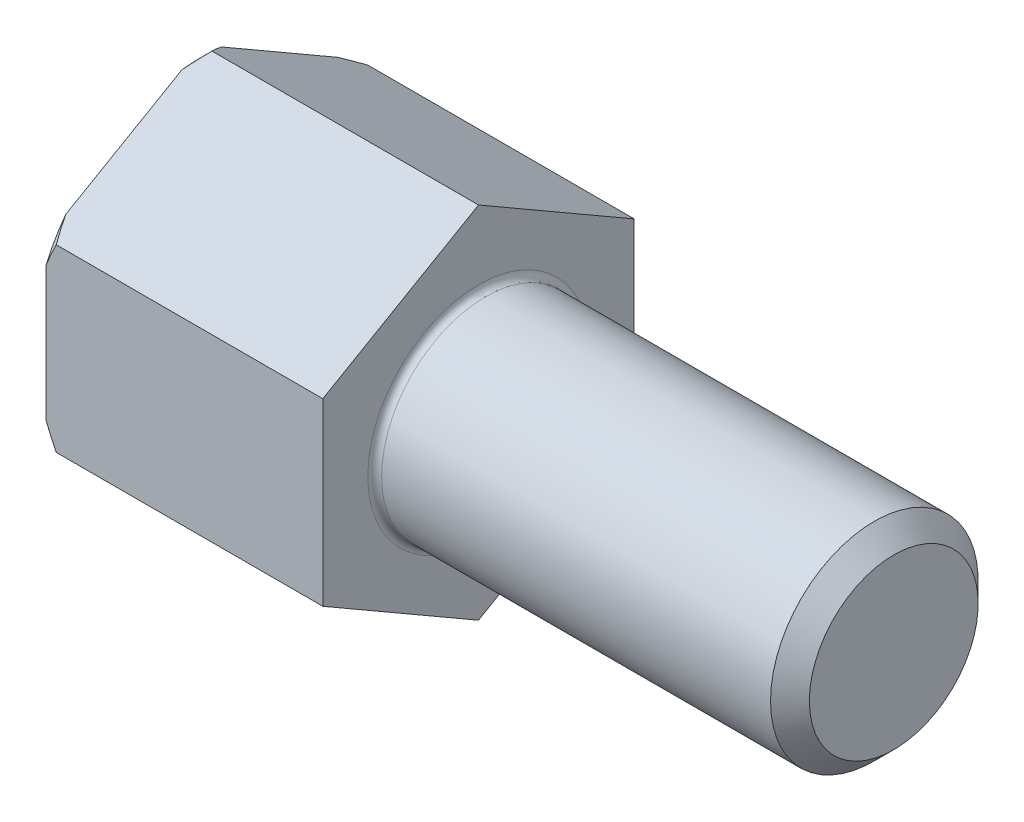
ISO-10303-21;
HEADER;
FILE_DESCRIPTION(('STEP AP214'),'2;1');
FILE_NAME('part.step','',(''),(''),'','','');
FILE_SCHEMA(('AUTOMOTIVE_DESIGN { 1 0 10303 214 1 1 1 1 }'));
ENDSEC;
DATA;
#1=APPLICATION_CONTEXT('core data for automotive mechanical design processes');
#2=APPLICATION_PROTOCOL_DEFINITION('international standard','automotive_design',2000,#1);
#3=PRODUCT_CONTEXT('',#1,'mechanical');
#4=PRODUCT('Part','Part','',(#3));
#5=PRODUCT_RELATED_PRODUCT_CATEGORY('part','',(#4));
#6=PRODUCT_DEFINITION_FORMATION('','',#4);
#7=PRODUCT_DEFINITION_CONTEXT('part definition',#1,'design');
#8=PRODUCT_DEFINITION('design','',#6,#7);
#9=PRODUCT_DEFINITION_SHAPE('','',#8);
#10=(LENGTH_UNIT() NAMED_UNIT(*) SI_UNIT(.MILLI.,.METRE.));
#11=(NAMED_UNIT(*) PLANE_ANGLE_UNIT() SI_UNIT($,.RADIAN.));
#12=(NAMED_UNIT(*) SI_UNIT($,.STERADIAN.) SOLID_ANGLE_UNIT());
#13=UNCERTAINTY_MEASURE_WITH_UNIT(LENGTH_MEASURE(1.E-05),#10,'distance_accuracy_value','');
#14=(GEOMETRIC_REPRESENTATION_CONTEXT(3) GLOBAL_UNCERTAINTY_ASSIGNED_CONTEXT((#13)) GLOBAL_UNIT_ASSIGNED_CONTEXT((#10,
#11,#12)) REPRESENTATION_CONTEXT('',''));
#15=CARTESIAN_POINT('',(0.,0.,0.));
#16=DIRECTION('',(0.,0.,1.));
#17=DIRECTION('',(1.,0.,0.));
#18=AXIS2_PLACEMENT_3D('',#15,#16,#17);
#19=CARTESIAN_POINT('',(4.,2.75,0.));
#20=DIRECTION('',(1.,0.,0.));
#21=DIRECTION('',(0.,0.,-1.));
#22=AXIS2_PLACEMENT_3D('',#19,#20,#21);
#23=PLANE('',#22);
#24=CARTESIAN_POINT('',(4.,0.,0.));
#25=DIRECTION('',(1.,0.,0.));
#26=DIRECTION('',(0.,0.,-1.));
#27=AXIS2_PLACEMENT_3D('',#24,#25,#26);
#28=CIRCLE('',#27,1.59999999999992);
#29=CARTESIAN_POINT('',(4.,0.,-1.59999999999992));
#30=VERTEX_POINT('',#29);
#31=EDGE_CURVE('E259',#30,#30,#28,.F.);
#32=ORIENTED_EDGE('',*,*,#31,.T.);
#33=EDGE_LOOP('',(#32));
#34=FACE_BOUND('',#33,.T.);
#35=DIRECTION('',(0.,0.5,-0.866025403784439));
#36=VECTOR('',#35,1.);
#37=CARTESIAN_POINT('',(4.,2.63605715851498,-0.0657849302036045));
#38=LINE('',#37,#36);
#39=CARTESIAN_POINT('',(4.,1.29903810567666,2.25));
#40=VERTEX_POINT('',#39);
#41=CARTESIAN_POINT('',(4.,2.59807621135332,0.));
#42=VERTEX_POINT('',#41);
#43=EDGE_CURVE('E246',#40,#42,#38,.T.);
#44=ORIENTED_EDGE('',*,*,#43,.F.);
#45=DIRECTION('',(0.,-1.,0.));
#46=VECTOR('',#45,1.);
#47=CARTESIAN_POINT('',(4.,2.75,2.24999999999999));
#48=LINE('',#47,#46);
#49=CARTESIAN_POINT('',(4.,-1.29903810567666,2.25));
#50=VERTEX_POINT('',#49);
#51=EDGE_CURVE('E236',#40,#50,#48,.T.);
#52=ORIENTED_EDGE('',*,*,#51,.T.);
#53=DIRECTION('',(0.,0.500000000000001,0.866025403784438));
#54=VECTOR('',#53,1.);
#55=CARTESIAN_POINT('',(4.,-1.26105715851499,2.31578493020361));
#56=LINE('',#55,#54);
#57=CARTESIAN_POINT('',(4.,-2.59807621135332,0.));
#58=VERTEX_POINT('',#57);
#59=EDGE_CURVE('E214',#58,#50,#56,.T.);
#60=ORIENTED_EDGE('',*,*,#59,.F.);
#61=DIRECTION('',(0.,-0.5,0.866025403784439));
#62=VECTOR('',#61,1.);
#63=CARTESIAN_POINT('',(4.,-1.26105715851499,-2.3157849302036));
#64=LINE('',#63,#62);
#65=CARTESIAN_POINT('',(4.,-1.29903810567666,-2.25));
#66=VERTEX_POINT('',#65);
#67=EDGE_CURVE('E205',#66,#58,#64,.T.);
#68=ORIENTED_EDGE('',*,*,#67,.F.);
#69=DIRECTION('',(0.,1.,0.));
#70=VECTOR('',#69,1.);
#71=CARTESIAN_POINT('',(4.,2.75,-2.25000000000001));
#72=LINE('',#71,#70);
#73=CARTESIAN_POINT('',(4.,1.29903810567665,-2.25));
#74=VERTEX_POINT('',#73);
#75=EDGE_CURVE('E195',#66,#74,#72,.T.);
#76=ORIENTED_EDGE('',*,*,#75,.T.);
#77=DIRECTION('',(0.,0.500000000000001,0.866025403784438));
#78=VECTOR('',#77,1.);
#79=CARTESIAN_POINT('',(4.,2.63605715851499,0.0657849302036022));
#80=LINE('',#79,#78);
#81=EDGE_CURVE('E167',#74,#42,#80,.T.);
#82=ORIENTED_EDGE('',*,*,#81,.T.);
#83=EDGE_LOOP('',(#44,#52,#60,#68,#76,#82));
#84=FACE_BOUND('',#83,.T.);
#85=ADVANCED_FACE('F40',(#34,#84),#23,.T.);
#86=CARTESIAN_POINT('',(10.,1.2195,0.));
#87=DIRECTION('',(1.,0.,0.));
#88=DIRECTION('',(0.,0.,-1.));
#89=AXIS2_PLACEMENT_3D('',#86,#87,#88);
#90=PLANE('',#89);
#91=CARTESIAN_POINT('',(10.,0.,0.));
#92=DIRECTION('',(-1.,0.,0.));
#93=DIRECTION('',(0.,0.,1.));
#94=AXIS2_PLACEMENT_3D('',#91,#92,#93);
#95=CIRCLE('',#94,1.2195);
#96=CARTESIAN_POINT('',(10.,0.,1.2195));
#97=VERTEX_POINT('',#96);
#98=EDGE_CURVE('E256',#97,#97,#95,.T.);
#99=ORIENTED_EDGE('',*,*,#98,.F.);
#100=EDGE_LOOP('',(#99));
#101=FACE_BOUND('',#100,.T.);
#102=ADVANCED_FACE('F329',(#101),#90,.T.);
#103=CARTESIAN_POINT('',(10.,0.,0.));
#104=DIRECTION('',(-1.,0.,0.));
#105=DIRECTION('',(0.,0.,1.));
#106=AXIS2_PLACEMENT_3D('',#103,#104,#105);
#107=CONICAL_SURFACE('',#106,1.2195,0.785398163397172);
#108=CARTESIAN_POINT('',(9.71949999999993,0.,0.));
#109=DIRECTION('',(-1.,0.,0.));
#110=DIRECTION('',(0.,0.,1.));
#111=AXIS2_PLACEMENT_3D('',#108,#109,#110);
#112=CIRCLE('',#111,1.49999999999992);
#113=CARTESIAN_POINT('',(9.71949999999993,0.,1.49999999999992));
#114=VERTEX_POINT('',#113);
#115=EDGE_CURVE('E252',#114,#114,#112,.T.);
#116=ORIENTED_EDGE('',*,*,#115,.F.);
#117=EDGE_LOOP('',(#116));
#118=FACE_BOUND('',#117,.T.);
#119=ORIENTED_EDGE('',*,*,#98,.T.);
#120=EDGE_LOOP('',(#119));
#121=FACE_BOUND('',#120,.T.);
#122=ADVANCED_FACE('F334',(#118,#121),#107,.T.);
#123=CARTESIAN_POINT('',(-31.75,0.,0.));
#124=DIRECTION('',(-1.,0.,0.));
#125=DIRECTION('',(0.,0.,1.));
#126=AXIS2_PLACEMENT_3D('',#123,#124,#125);
#127=CYLINDRICAL_SURFACE('',#126,1.49999999999992);
#128=CARTESIAN_POINT('',(4.1,0.,0.));
#129=DIRECTION('',(1.,0.,0.));
#130=DIRECTION('',(0.,0.,-1.));
#131=AXIS2_PLACEMENT_3D('',#128,#129,#130);
#132=CIRCLE('',#131,1.49999999999992);
#133=CARTESIAN_POINT('',(4.1,0.,-1.49999999999992));
#134=VERTEX_POINT('',#133);
#135=EDGE_CURVE('E262',#134,#134,#132,.T.);
#136=ORIENTED_EDGE('',*,*,#135,.T.);
#137=EDGE_LOOP('',(#136));
#138=FACE_BOUND('',#137,.T.);
#139=ORIENTED_EDGE('',*,*,#115,.T.);
#140=EDGE_LOOP('',(#139));
#141=FACE_BOUND('',#140,.T.);
#142=ADVANCED_FACE('F337',(#138,#141),#127,.T.);
#143=CARTESIAN_POINT('',(4.1,0.,0.));
#144=DIRECTION('',(1.,0.,0.));
#145=DIRECTION('',(0.,0.,-1.));
#146=AXIS2_PLACEMENT_3D('',#143,#144,#145);
#147=TOROIDAL_SURFACE('',#146,1.59999999999992,0.1);
#148=ORIENTED_EDGE('',*,*,#135,.F.);
#149=EDGE_LOOP('',(#148));
#150=FACE_BOUND('',#149,.T.);
#151=ORIENTED_EDGE('',*,*,#31,.F.);
#152=EDGE_LOOP('',(#151));
#153=FACE_BOUND('',#152,.T.);
#154=ADVANCED_FACE('F42',(#150,#153),#147,.F.);
#155=CARTESIAN_POINT('',(10.,2.59807621135332,0.));
#156=DIRECTION('',(0.,-0.866025403784439,-0.5));
#157=DIRECTION('',(0.,0.5,-0.866025403784439));
#158=AXIS2_PLACEMENT_3D('',#155,#156,#157);
#159=PLANE('',#158);
#160=DIRECTION('',(-1.,0.,0.));
#161=VECTOR('',#160,1.);
#162=CARTESIAN_POINT('',(10.,1.29903810567666,2.25));
#163=LINE('',#162,#161);
#164=CARTESIAN_POINT('',(0.148076211353313,1.29903810567666,2.25));
#165=VERTEX_POINT('',#164);
#166=EDGE_CURVE('E156',#40,#165,#163,.T.);
#167=ORIENTED_EDGE('',*,*,#166,.F.);
#168=ORIENTED_EDGE('',*,*,#43,.T.);
#169=DIRECTION('',(-1.,0.,0.));
#170=VECTOR('',#169,1.);
#171=CARTESIAN_POINT('',(10.,2.59807621135332,0.));
#172=LINE('',#171,#170);
#173=CARTESIAN_POINT('',(0.148076211353317,2.59807621135332,0.));
#174=VERTEX_POINT('',#173);
#175=EDGE_CURVE('E55',#42,#174,#172,.T.);
#176=ORIENTED_EDGE('',*,*,#175,.T.);
#177=CARTESIAN_POINT('',(1.38956349354383,3.50417181363964,-1.56940361967465));
#178=CARTESIAN_POINT('',(1.33965485491722,3.47337351467164,-1.51605940107536));
#179=CARTESIAN_POINT('',(1.29004887573799,3.44245277961855,-1.46250311695604));
#180=CARTESIAN_POINT('',(1.19155041800895,3.38032420316097,-1.35489326592958));
#181=CARTESIAN_POINT('',(1.14265800303582,3.34911633657284,-1.30083965540311));
#182=CARTESIAN_POINT('',(0.996999597779199,3.25485999237001,-1.13758287830811));
#183=CARTESIAN_POINT('',(0.901487238220858,3.19132262847131,-1.02753293585658));
#184=CARTESIAN_POINT('',(0.712599791533918,3.06075116421142,-0.801376525739781));
#185=CARTESIAN_POINT('',(0.619356927651705,2.99366895508622,-0.685186731250966));
#186=CARTESIAN_POINT('',(0.440289502999963,2.8571204547661,-0.448677790999188));
#187=CARTESIAN_POINT('',(0.354457521571661,2.78765664804196,-0.328362948465835));
#188=CARTESIAN_POINT('',(0.233314827318496,2.68020698894853,-0.142254679660051));
#189=CARTESIAN_POINT('',(0.193801904945935,2.64341516732573,-0.0785293753063631));
#190=CARTESIAN_POINT('',(0.118569264031108,2.56888100114376,0.0505675874205978));
#191=CARTESIAN_POINT('',(0.0828500853859291,2.53113852223719,0.115939478490372));
#192=CARTESIAN_POINT('',(-0.0168099276584709,2.41670826630443,0.314138495689022));
#193=CARTESIAN_POINT('',(-0.0737915552570118,2.33836371949835,0.449835231253115));
#194=CARTESIAN_POINT('',(-0.133519092591402,2.22580767076384,0.644788026360477));
#195=CARTESIAN_POINT('',(-0.148334695954519,2.19317239147085,0.701313988215142));
#196=CARTESIAN_POINT('',(-0.172655949928301,2.12741762504018,0.815204584512882));
#197=CARTESIAN_POINT('',(-0.182164445719272,2.09429840713775,0.872568752626841));
#198=CARTESIAN_POINT('',(-0.195390558823208,2.02782077232066,0.987711393697048));
#199=CARTESIAN_POINT('',(-0.199117133837629,1.99446280601135,1.04548908618194));
#200=CARTESIAN_POINT('',(-0.200603742240033,1.92771240286019,1.16110417586547));
#201=CARTESIAN_POINT('',(-0.198363708389566,1.89431996563411,1.21894157372959));
#202=CARTESIAN_POINT('',(-0.188055161119292,1.82785533205276,1.33406169599893));
#203=CARTESIAN_POINT('',(-0.180002420396564,1.79478251401188,1.39134549719521));
#204=CARTESIAN_POINT('',(-0.158498268310681,1.72907720866472,1.50515042438333));
#205=CARTESIAN_POINT('',(-0.145045608753623,1.6964448249689,1.56167137091657));
#206=CARTESIAN_POINT('',(-0.113295569447993,1.63167988967214,1.67384752939946));
#207=CARTESIAN_POINT('',(-0.094984022830986,1.59954909539925,1.72949969756766));
#208=CARTESIAN_POINT('',(-0.0542102947783968,1.53596253110388,1.83963485760598));
#209=CARTESIAN_POINT('',(-0.031748312812983,1.50450672872231,1.8941179055237));
#210=CARTESIAN_POINT('',(0.0253766525682736,1.43109498615018,2.02127077353081));
#211=CARTESIAN_POINT('',(0.0615231801772885,1.38942875415872,2.09343880429996));
#212=CARTESIAN_POINT('',(0.138862691263032,1.30727562859454,2.23573219177771));
#213=CARTESIAN_POINT('',(0.18005835494802,1.26678937562111,2.30585643893578));
#214=CARTESIAN_POINT('',(0.266445407392794,1.18679606165464,2.44440892299152));
#215=CARTESIAN_POINT('',(0.311644939815624,1.14729121577708,2.51283332319662));
#216=CARTESIAN_POINT('',(0.40509922301932,1.06921197761058,2.64807053071728));
#217=CARTESIAN_POINT('',(0.453353433521689,1.03063742243933,2.71488362015325));
#218=CARTESIAN_POINT('',(0.602154225761355,0.915733123098446,2.91390370461976));
#219=CARTESIAN_POINT('',(0.70633451845413,0.840582723881126,3.04406801427324));
#220=CARTESIAN_POINT('',(0.920718685183836,0.6926140991221,3.30035719028197));
#221=CARTESIAN_POINT('',(1.03091648150611,0.61979363408633,3.42648593555472));
#222=CARTESIAN_POINT('',(1.18384094334647,0.521729341033111,3.59633827353122));
#223=CARTESIAN_POINT('',(1.22475657221562,0.495774156911396,3.64129397114983));
#224=CARTESIAN_POINT('',(1.30690037748831,0.444165621284563,3.73068257695973));
#225=CARTESIAN_POINT('',(1.34812651717398,0.418511459642814,3.77511688834883));
#226=CARTESIAN_POINT('',(1.38956349354382,0.392942503390328,3.81940361967464));
#227=B_SPLINE_CURVE_WITH_KNOTS('',3,(#177,#178,#179,#180,#181,#182,#183,#184,#185,#186,#187,
#188,#189,#190,#191,#192,#193,#194,#195,#196,#197,#198,#199,#200,#201,#202,#203,#204,#205,#206,
#207,#208,#209,#210,#211,#212,#213,#214,#215,#216,#217,#218,#219,#220,#221,#222,#223,#224,#225,
#226),.UNSPECIFIED.,.F.,.F.,(4,2,2,2,2,2,2,2,2,2,2,2,2,2,2,2,2,2,2,2,2,2,2,2,4),(0.,
0.237831856298369,0.475684774989147,0.952504404028155,1.44251492737563,1.93202896156976,
2.18248661479591,2.43297986364782,2.93081336405965,3.13143070493916,3.33194038979179,
3.53213912161983,3.73234010952155,3.93199988728958,4.13170584311499,4.33200059690363,
4.53228572701713,4.80455934119044,5.07697811613419,5.34996429031275,5.62290231581841,
6.17125052849525,6.71905479718201,6.91734296941923,7.11479764663136),.UNSPECIFIED.);
#228=CARTESIAN_POINT('',(0.,2.43332514425662,0.285357218812662));
#229=VERTEX_POINT('',#228);
#230=EDGE_CURVE('E245',#174,#229,#227,.T.);
#231=ORIENTED_EDGE('',*,*,#230,.T.);
#232=DIRECTION('',(0.,-0.5,0.866025403784439));
#233=VECTOR('',#232,1.);
#234=CARTESIAN_POINT('',(0.,1.94855715851498,1.125));
#235=LINE('',#234,#233);
#236=CARTESIAN_POINT('',(0.,1.46378917277335,1.96464278118734));
#237=VERTEX_POINT('',#236);
#238=EDGE_CURVE('E12',#229,#237,#235,.T.);
#239=ORIENTED_EDGE('',*,*,#238,.T.);
#240=EDGE_CURVE('E239',#237,#165,#227,.T.);
#241=ORIENTED_EDGE('',*,*,#240,.T.);
#242=EDGE_LOOP('',(#167,#168,#176,#231,#239,#241));
#243=FACE_BOUND('',#242,.T.);
#244=ADVANCED_FACE('F225',(#243),#159,.F.);
#245=CARTESIAN_POINT('',(10.,-1.29903810567666,2.25));
#246=DIRECTION('',(0.,0.,1.));
#247=DIRECTION('',(0.,-1.,0.));
#248=AXIS2_PLACEMENT_3D('',#245,#246,#247);
#249=PLANE('',#248);
#250=ORIENTED_EDGE('',*,*,#51,.F.);
#251=ORIENTED_EDGE('',*,*,#166,.T.);
#252=CARTESIAN_POINT('',(1.19560803320055,-2.8684417253513,2.25));
#253=CARTESIAN_POINT('',(1.1450111615432,-2.80412487936931,2.25));
#254=CARTESIAN_POINT('',(1.09480208722197,-2.73949899660477,2.25));
#255=CARTESIAN_POINT('',(0.995326277795939,-2.60950974966499,2.25));
#256=CARTESIAN_POINT('',(0.946059699272549,-2.54414626576754,2.25));
#257=CARTESIAN_POINT('',(0.848405598993678,-2.41225017150865,2.25));
#258=CARTESIAN_POINT('',(0.800023797140556,-2.34571331505328,2.25));
#259=CARTESIAN_POINT('',(0.704636716137816,-2.21166271624502,2.25));
#260=CARTESIAN_POINT('',(0.657631371063428,-2.14414902090955,2.25));
#261=CARTESIAN_POINT('',(0.563002092351626,-2.0046050446458,2.25));
#262=CARTESIAN_POINT('',(0.515463194774029,-1.93251687730629,2.25));
#263=CARTESIAN_POINT('',(0.422679962261214,-1.78688032148459,2.25));
#264=CARTESIAN_POINT('',(0.377435435817015,-1.71333205559088,2.25));
#265=CARTESIAN_POINT('',(0.289907877591605,-1.56467215105607,2.25));
#266=CARTESIAN_POINT('',(0.247619387609034,-1.4895637448277,2.25));
#267=CARTESIAN_POINT('',(0.166684571928322,-1.33741813962644,2.25));
#268=CARTESIAN_POINT('',(0.12803725481263,-1.26038147295239,2.25));
#269=CARTESIAN_POINT('',(0.0591346790092825,-1.11224795470599,2.25));
#270=CARTESIAN_POINT('',(0.0284247431298476,-1.04136416293652,2.25));
#271=CARTESIAN_POINT('',(-0.0284074028507688,-0.897751599056984,2.25));
#272=CARTESIAN_POINT('',(-0.0545291725749484,-0.82502265061271,2.25));
#273=CARTESIAN_POINT('',(-0.100905921124525,-0.678605258667869,2.25));
#274=CARTESIAN_POINT('',(-0.121224363594545,-0.604937193851524,2.25));
#275=CARTESIAN_POINT('',(-0.155374302964485,-0.456118834886516,2.25));
#276=CARTESIAN_POINT('',(-0.169208398573311,-0.380969147127066,2.25));
#277=CARTESIAN_POINT('',(-0.189740473043699,-0.228249239988753,2.25));
#278=CARTESIAN_POINT('',(-0.196300267449367,-0.150660030751469,2.25));
#279=CARTESIAN_POINT('',(-0.201335754653149,0.00477860687580444,2.25));
#280=CARTESIAN_POINT('',(-0.199812150005818,0.0826280120635858,2.25));
#281=CARTESIAN_POINT('',(-0.188780749107252,0.237987187801296,2.25));
#282=CARTESIAN_POINT('',(-0.179248561980909,0.315495192827886,2.25));
#283=CARTESIAN_POINT('',(-0.152840224692754,0.469242252541659,2.25));
#284=CARTESIAN_POINT('',(-0.13596210656056,0.545480961498766,2.25));
#285=CARTESIAN_POINT('',(-0.0896292563756563,0.719670195710907,2.25));
#286=CARTESIAN_POINT('',(-0.0578965298682648,0.817009849952895,2.25));
#287=CARTESIAN_POINT('',(0.0140677894975261,1.00847620304259,2.25));
#288=CARTESIAN_POINT('',(0.0543044957444195,1.10260092904116,2.25));
#289=CARTESIAN_POINT('',(0.14150195099445,1.28847491564035,2.25));
#290=CARTESIAN_POINT('',(0.188509380032974,1.38020197886321,2.25));
#291=CARTESIAN_POINT('',(0.287389666851661,1.56093565221082,2.25));
#292=CARTESIAN_POINT('',(0.33926138454899,1.64994289335036,2.25));
#293=CARTESIAN_POINT('',(0.453947505487043,1.8375658055387,2.25));
#294=CARTESIAN_POINT('',(0.517293376499227,1.9358544228592,2.25));
#295=CARTESIAN_POINT('',(0.647509232001908,2.13008097858503,2.25));
#296=CARTESIAN_POINT('',(0.714379975487861,2.22601840414986,2.24999999999999));
#297=CARTESIAN_POINT('',(0.849264345549588,2.41388455145359,2.24999999999999));
#298=CARTESIAN_POINT('',(0.91722016115619,2.50585501474068,2.24999999999999));
#299=CARTESIAN_POINT('',(1.05507834370763,2.68822689085584,2.24999999999999));
#300=CARTESIAN_POINT('',(1.12497931307402,2.77862935814874,2.24999999999999));
#301=CARTESIAN_POINT('',(1.19560803320054,2.8684417253513,2.24999999999999));
#302=B_SPLINE_CURVE_WITH_KNOTS('',3,(#252,#253,#254,#255,#256,#257,#258,#259,#260,#261,#262,
#263,#264,#265,#266,#267,#268,#269,#270,#271,#272,#273,#274,#275,#276,#277,#278,#279,#280,#281,
#282,#283,#284,#285,#286,#287,#288,#289,#290,#291,#292,#293,#294,#295,#296,#297,#298,#299,#300,
#301),.UNSPECIFIED.,.F.,.F.,(4,2,2,2,2,2,2,2,2,2,2,2,2,2,2,2,2,2,2,2,2,2,2,2,4),(0.,
0.245503234786309,0.491046908091924,0.737834898600815,0.98461104991463,1.24363201899954,
1.50263133214255,1.76113903919262,2.0195761551799,2.25119815333278,2.48284237067425,
2.71184685405785,2.94075948148189,3.17394982672687,3.40711990497107,3.64100270929032,
3.87494820927291,4.18155383361919,4.48834434515738,4.79736136959428,5.10630614736502,
5.45700201658771,5.80777371057626,6.15080251895842,6.49359092254174),.UNSPECIFIED.);
#303=CARTESIAN_POINT('',(0.,0.969535971483272,2.25));
#304=VERTEX_POINT('',#303);
#305=EDGE_CURVE('E228',#304,#165,#302,.T.);
#306=ORIENTED_EDGE('',*,*,#305,.F.);
#307=DIRECTION('',(0.,1.,0.));
#308=VECTOR('',#307,1.);
#309=CARTESIAN_POINT('',(0.,0.,2.25));
#310=LINE('',#309,#308);
#311=CARTESIAN_POINT('',(0.,-0.969535971483266,2.25));
#312=VERTEX_POINT('',#311);
#313=EDGE_CURVE('E48',#312,#304,#310,.T.);
#314=ORIENTED_EDGE('',*,*,#313,.F.);
#315=CARTESIAN_POINT('',(0.148076211353318,-1.29903810567666,2.25));
#316=VERTEX_POINT('',#315);
#317=EDGE_CURVE('E235',#316,#312,#302,.T.);
#318=ORIENTED_EDGE('',*,*,#317,.F.);
#319=DIRECTION('',(-1.,0.,0.));
#320=VECTOR('',#319,1.);
#321=CARTESIAN_POINT('',(10.,-1.29903810567666,2.25));
#322=LINE('',#321,#320);
#323=EDGE_CURVE('E153',#50,#316,#322,.T.);
#324=ORIENTED_EDGE('',*,*,#323,.F.);
#325=EDGE_LOOP('',(#250,#251,#306,#314,#318,#324));
#326=FACE_BOUND('',#325,.T.);
#327=ADVANCED_FACE('F220',(#326),#249,.T.);
#328=CARTESIAN_POINT('',(10.,-1.29903810567666,2.25));
#329=DIRECTION('',(0.,0.866025403784438,-0.500000000000001));
#330=DIRECTION('',(0.,0.500000000000001,0.866025403784438));
#331=AXIS2_PLACEMENT_3D('',#328,#329,#330);
#332=PLANE('',#331);
#333=DIRECTION('',(-1.,0.,0.));
#334=VECTOR('',#333,1.);
#335=CARTESIAN_POINT('',(10.,-2.59807621135332,0.));
#336=LINE('',#335,#334);
#337=CARTESIAN_POINT('',(0.148076211353322,-2.59807621135332,0.));
#338=VERTEX_POINT('',#337);
#339=EDGE_CURVE('E150',#58,#338,#336,.T.);
#340=ORIENTED_EDGE('',*,*,#339,.F.);
#341=ORIENTED_EDGE('',*,*,#59,.T.);
#342=ORIENTED_EDGE('',*,*,#323,.T.);
#343=CARTESIAN_POINT('',(1.38956349354383,-0.392942503390329,3.81940361967464));
#344=CARTESIAN_POINT('',(1.33965485491722,-0.423740802358336,3.76605940107536));
#345=CARTESIAN_POINT('',(1.29004887573799,-0.454661537411425,3.71250311695603));
#346=CARTESIAN_POINT('',(1.19155041800895,-0.516790113869008,3.60489326592957));
#347=CARTESIAN_POINT('',(1.14265800303582,-0.547997980457137,3.5508396554031));
#348=CARTESIAN_POINT('',(0.996999597779196,-0.642254324659963,3.38758287830811));
#349=CARTESIAN_POINT('',(0.901487238220854,-0.705791688558662,3.27753293585657));
#350=CARTESIAN_POINT('',(0.712599791533914,-0.836363152818554,3.05137652573977));
#351=CARTESIAN_POINT('',(0.619356927651701,-0.903445361943759,2.93518673125096));
#352=CARTESIAN_POINT('',(0.440289502999958,-1.03999386226388,2.69867779099918));
#353=CARTESIAN_POINT('',(0.354457521571656,-1.10945766898802,2.57836294846582));
#354=CARTESIAN_POINT('',(0.233314827318492,-1.21690732808145,2.39225467966004));
#355=CARTESIAN_POINT('',(0.193801904945931,-1.25369914970424,2.32852937530635));
#356=CARTESIAN_POINT('',(0.118569264031106,-1.32823331588622,2.19943241257939));
#357=CARTESIAN_POINT('',(0.0828500853859275,-1.36597579479279,2.13406052150962));
#358=CARTESIAN_POINT('',(-0.0168099276584706,-1.48040605072555,1.93586150431097));
#359=CARTESIAN_POINT('',(-0.0737915552570104,-1.55875059753163,1.80016476874688));
#360=CARTESIAN_POINT('',(-0.133519092591399,-1.67130664626613,1.60521197363951));
#361=CARTESIAN_POINT('',(-0.148334695954516,-1.70394192555913,1.54868601178485));
#362=CARTESIAN_POINT('',(-0.172655949928298,-1.7696966919898,1.43479541548711));
#363=CARTESIAN_POINT('',(-0.182164445719268,-1.80281590989223,1.37743124737315));
#364=CARTESIAN_POINT('',(-0.195390558823203,-1.86929354470932,1.26228860630294));
#365=CARTESIAN_POINT('',(-0.199117133837623,-1.90265151101862,1.20451091381805));
#366=CARTESIAN_POINT('',(-0.200603742240027,-1.96940191416979,1.08889582413452));
#367=CARTESIAN_POINT('',(-0.19836370838956,-2.00279435139587,1.0310584262704));
#368=CARTESIAN_POINT('',(-0.188055161119285,-2.06925898497722,0.915938304001057));
#369=CARTESIAN_POINT('',(-0.180002420396556,-2.1023318030181,0.858654502804776));
#370=CARTESIAN_POINT('',(-0.158498268310673,-2.16803710836526,0.744849575616659));
#371=CARTESIAN_POINT('',(-0.145045608753614,-2.20066949206108,0.688328629083419));
#372=CARTESIAN_POINT('',(-0.113295569447984,-2.26543442735784,0.576152470600531));
#373=CARTESIAN_POINT('',(-0.0949840228309773,-2.29756522163073,0.520500302432332));
#374=CARTESIAN_POINT('',(-0.0542102947783875,-2.3611517859261,0.410365142394011));
#375=CARTESIAN_POINT('',(-0.031748312812973,-2.39260758830766,0.355882094476292));
#376=CARTESIAN_POINT('',(0.0253766525682851,-2.4660193308798,0.228729226469179));
#377=CARTESIAN_POINT('',(0.0615231801773006,-2.50768556287126,0.156561195700025));
#378=CARTESIAN_POINT('',(0.138862691263045,-2.58983868843544,0.0142678082222789));
#379=CARTESIAN_POINT('',(0.180058354948034,-2.63032494140888,-0.0558564389357974));
#380=CARTESIAN_POINT('',(0.26644540739281,-2.71031825537535,-0.194408922991534));
#381=CARTESIAN_POINT('',(0.311644939815641,-2.7498231012529,-0.262833323196639));
#382=CARTESIAN_POINT('',(0.405099223019339,-2.82790233941941,-0.398070530717296));
#383=CARTESIAN_POINT('',(0.453353433521709,-2.86647689459066,-0.46488362015327));
#384=CARTESIAN_POINT('',(0.602154225761378,-2.98138119393154,-0.663903704619781));
#385=CARTESIAN_POINT('',(0.706334518454154,-3.05653159314886,-0.794068014273264));
#386=CARTESIAN_POINT('',(0.920718685183864,-3.20450021790789,-1.05035719028199));
#387=CARTESIAN_POINT('',(1.03091648150614,-3.27732068294366,-1.17648593555474));
#388=CARTESIAN_POINT('',(1.1838409433465,-3.37538497599688,-1.34633827353124));
#389=CARTESIAN_POINT('',(1.22475657221565,-3.40134016011859,-1.39129397114985));
#390=CARTESIAN_POINT('',(1.30690037748832,-3.45294869574542,-1.48068257695975));
#391=CARTESIAN_POINT('',(1.34812651717399,-3.47860285738717,-1.52511688834884));
#392=CARTESIAN_POINT('',(1.38956349354383,-3.50417181363965,-1.56940361967464));
#393=B_SPLINE_CURVE_WITH_KNOTS('',3,(#343,#344,#345,#346,#347,#348,#349,#350,#351,#352,#353,
#354,#355,#356,#357,#358,#359,#360,#361,#362,#363,#364,#365,#366,#367,#368,#369,#370,#371,#372,
#373,#374,#375,#376,#377,#378,#379,#380,#381,#382,#383,#384,#385,#386,#387,#388,#389,#390,#391,
#392),.UNSPECIFIED.,.F.,.F.,(4,2,2,2,2,2,2,2,2,2,2,2,2,2,2,2,2,2,2,2,2,2,2,2,4),(0.,
0.23783185629837,0.475684774989149,0.95250440402816,1.44251492737564,1.93202896156977,
2.18248661479592,2.43297986364783,2.93081336405966,3.13143070493916,3.3319403897918,
3.53213912161983,3.73234010952156,3.93199988728959,4.13170584311499,4.33200059690363,
4.53228572701714,4.80455934119044,5.0769781161342,5.34996429031276,5.62290231581843,
6.17125052849528,6.71905479718204,6.91734296941924,7.11479764663135),.UNSPECIFIED.);
#394=CARTESIAN_POINT('',(0.,-1.46378917277336,1.96464278118733));
#395=VERTEX_POINT('',#394);
#396=EDGE_CURVE('E213',#316,#395,#393,.T.);
#397=ORIENTED_EDGE('',*,*,#396,.T.);
#398=DIRECTION('',(0.,-0.500000000000001,-0.866025403784438));
#399=VECTOR('',#398,1.);
#400=CARTESIAN_POINT('',(0.,-1.94855715851499,1.125));
#401=LINE('',#400,#399);
#402=CARTESIAN_POINT('',(0.,-2.43332514425662,0.285357218812678));
#403=VERTEX_POINT('',#402);
#404=EDGE_CURVE('E272',#395,#403,#401,.T.);
#405=ORIENTED_EDGE('',*,*,#404,.T.);
#406=EDGE_CURVE('E207',#403,#338,#393,.T.);
#407=ORIENTED_EDGE('',*,*,#406,.T.);
#408=EDGE_LOOP('',(#340,#341,#342,#397,#405,#407));
#409=FACE_BOUND('',#408,.T.);
#410=ADVANCED_FACE('F216',(#409),#332,.F.);
#411=CARTESIAN_POINT('',(10.,-2.59807621135332,0.));
#412=DIRECTION('',(0.,0.866025403784439,0.5));
#413=DIRECTION('',(0.,-0.5,0.866025403784439));
#414=AXIS2_PLACEMENT_3D('',#411,#412,#413);
#415=PLANE('',#414);
#416=DIRECTION('',(-1.,0.,0.));
#417=VECTOR('',#416,1.);
#418=CARTESIAN_POINT('',(10.,-1.29903810567666,-2.25));
#419=LINE('',#418,#417);
#420=CARTESIAN_POINT('',(0.14807621135332,-1.29903810567666,-2.25));
#421=VERTEX_POINT('',#420);
#422=EDGE_CURVE('E147',#66,#421,#419,.T.);
#423=ORIENTED_EDGE('',*,*,#422,.F.);
#424=ORIENTED_EDGE('',*,*,#67,.T.);
#425=ORIENTED_EDGE('',*,*,#339,.T.);
#426=CARTESIAN_POINT('',(1.38956349354383,-3.50417181363965,1.56940361967464));
#427=CARTESIAN_POINT('',(1.33965485491722,-3.47337351467164,1.51605940107536));
#428=CARTESIAN_POINT('',(1.29004887573799,-3.44245277961855,1.46250311695603));
#429=CARTESIAN_POINT('',(1.19155041800895,-3.38032420316097,1.35489326592957));
#430=CARTESIAN_POINT('',(1.14265800303582,-3.34911633657284,1.3008396554031));
#431=CARTESIAN_POINT('',(0.996999597779198,-3.25485999237001,1.13758287830811));
#432=CARTESIAN_POINT('',(0.901487238220856,-3.19132262847131,1.02753293585657));
#433=CARTESIAN_POINT('',(0.712599791533916,-3.06075116421142,0.801376525739768));
#434=CARTESIAN_POINT('',(0.619356927651702,-2.99366895508622,0.685186731250953));
#435=CARTESIAN_POINT('',(0.440289502999959,-2.8571204547661,0.448677790999172));
#436=CARTESIAN_POINT('',(0.354457521571657,-2.78765664804196,0.328362948465817));
#437=CARTESIAN_POINT('',(0.233314827318492,-2.68020698894852,0.142254679660032));
#438=CARTESIAN_POINT('',(0.193801904945931,-2.64341516732573,0.0785293753063451));
#439=CARTESIAN_POINT('',(0.118569264031106,-2.56888100114376,-0.0505675874206151));
#440=CARTESIAN_POINT('',(0.0828500853859281,-2.53113852223719,-0.115939478490389));
#441=CARTESIAN_POINT('',(-0.0168099276584697,-2.41670826630443,-0.314138495689038));
#442=CARTESIAN_POINT('',(-0.0737915552570096,-2.33836371949835,-0.449835231253131));
#443=CARTESIAN_POINT('',(-0.133519092591398,-2.22580767076384,-0.644788026360492));
#444=CARTESIAN_POINT('',(-0.148334695954515,-2.19317239147085,-0.701313988215157));
#445=CARTESIAN_POINT('',(-0.172655949928296,-2.12741762504018,-0.815204584512898));
#446=CARTESIAN_POINT('',(-0.182164445719267,-2.09429840713775,-0.872568752626857));
#447=CARTESIAN_POINT('',(-0.195390558823201,-2.02782077232066,-0.987711393697064));
#448=CARTESIAN_POINT('',(-0.199117133837622,-1.99446280601135,-1.04548908618195));
#449=CARTESIAN_POINT('',(-0.200603742240025,-1.92771240286019,-1.16110417586548));
#450=CARTESIAN_POINT('',(-0.198363708389558,-1.89431996563411,-1.21894157372961));
#451=CARTESIAN_POINT('',(-0.188055161119283,-1.82785533205276,-1.33406169599895));
#452=CARTESIAN_POINT('',(-0.180002420396554,-1.79478251401188,-1.39134549719523));
#453=CARTESIAN_POINT('',(-0.158498268310671,-1.72907720866472,-1.50515042438335));
#454=CARTESIAN_POINT('',(-0.145045608753612,-1.6964448249689,-1.56167137091659));
#455=CARTESIAN_POINT('',(-0.113295569447982,-1.63167988967214,-1.67384752939948));
#456=CARTESIAN_POINT('',(-0.0949840228309748,-1.59954909539925,-1.72949969756768));
#457=CARTESIAN_POINT('',(-0.054210294778385,-1.53596253110388,-1.839634857606));
#458=CARTESIAN_POINT('',(-0.0317483128129709,-1.50450672872231,-1.89411790552371));
#459=CARTESIAN_POINT('',(0.0253766525682872,-1.43109498615017,-2.02127077353083));
#460=CARTESIAN_POINT('',(0.0615231801773033,-1.38942875415872,-2.09343880429998));
#461=CARTESIAN_POINT('',(0.138862691263048,-1.30727562859454,-2.23573219177773));
#462=CARTESIAN_POINT('',(0.180058354948037,-1.2667893756211,-2.30585643893581));
#463=CARTESIAN_POINT('',(0.266445407392812,-1.18679606165463,-2.44440892299154));
#464=CARTESIAN_POINT('',(0.311644939815644,-1.14729121577708,-2.51283332319665));
#465=CARTESIAN_POINT('',(0.405099223019343,-1.06921197761057,-2.64807053071731));
#466=CARTESIAN_POINT('',(0.453353433521713,-1.03063742243932,-2.71488362015328));
#467=CARTESIAN_POINT('',(0.602154225761382,-0.915733123098438,-2.91390370461979));
#468=CARTESIAN_POINT('',(0.706334518454159,-0.840582723881117,-3.04406801427328));
#469=CARTESIAN_POINT('',(0.920718685183869,-0.692614099122089,-3.30035719028201));
#470=CARTESIAN_POINT('',(1.03091648150615,-0.619793634086318,-3.42648593555476));
#471=CARTESIAN_POINT('',(1.1838409433465,-0.521729341033101,-3.59633827353125));
#472=CARTESIAN_POINT('',(1.22475657221565,-0.49577415691139,-3.64129397114986));
#473=CARTESIAN_POINT('',(1.30690037748832,-0.444165621284563,-3.73068257695975));
#474=CARTESIAN_POINT('',(1.34812651717399,-0.418511459642818,-3.77511688834884));
#475=CARTESIAN_POINT('',(1.38956349354383,-0.392942503390336,-3.81940361967464));
#476=B_SPLINE_CURVE_WITH_KNOTS('',3,(#426,#427,#428,#429,#430,#431,#432,#433,#434,#435,#436,
#437,#438,#439,#440,#441,#442,#443,#444,#445,#446,#447,#448,#449,#450,#451,#452,#453,#454,#455,
#456,#457,#458,#459,#460,#461,#462,#463,#464,#465,#466,#467,#468,#469,#470,#471,#472,#473,#474,
#475),.UNSPECIFIED.,.F.,.F.,(4,2,2,2,2,2,2,2,2,2,2,2,2,2,2,2,2,2,2,2,2,2,2,2,4),(0.,
0.237831856298371,0.47568477498915,0.952504404028162,1.44251492737564,1.93202896156977,
2.18248661479592,2.43297986364783,2.93081336405966,3.13143070493916,3.3319403897918,
3.53213912161984,3.73234010952156,3.93199988728959,4.131705843115,4.33200059690364,
4.53228572701714,4.80455934119045,5.07697811613421,5.34996429031277,5.62290231581844,
6.17125052849529,6.71905479718205,6.91734296941925,7.11479764663135),.UNSPECIFIED.);
#477=CARTESIAN_POINT('',(0.,-2.43332514425662,-0.285357218812679));
#478=VERTEX_POINT('',#477);
#479=EDGE_CURVE('E204',#338,#478,#476,.T.);
#480=ORIENTED_EDGE('',*,*,#479,.T.);
#481=DIRECTION('',(0.,0.5,-0.866025403784439));
#482=VECTOR('',#481,1.);
#483=CARTESIAN_POINT('',(0.,-1.94855715851499,-1.125));
#484=LINE('',#483,#482);
#485=CARTESIAN_POINT('',(0.,-1.46378917277336,-1.96464278118732));
#486=VERTEX_POINT('',#485);
#487=EDGE_CURVE('E270',#478,#486,#484,.T.);
#488=ORIENTED_EDGE('',*,*,#487,.T.);
#489=EDGE_CURVE('E198',#486,#421,#476,.T.);
#490=ORIENTED_EDGE('',*,*,#489,.T.);
#491=EDGE_LOOP('',(#423,#424,#425,#480,#488,#490));
#492=FACE_BOUND('',#491,.T.);
#493=ADVANCED_FACE('F183',(#492),#415,.F.);
#494=CARTESIAN_POINT('',(10.,1.29903810567665,-2.25));
#495=DIRECTION('',(0.,0.,-1.));
#496=DIRECTION('',(0.,1.,0.));
#497=AXIS2_PLACEMENT_3D('',#494,#495,#496);
#498=PLANE('',#497);
#499=ORIENTED_EDGE('',*,*,#75,.F.);
#500=ORIENTED_EDGE('',*,*,#422,.T.);
#501=CARTESIAN_POINT('',(1.19560803320055,2.8684417253513,-2.25000000000001));
#502=CARTESIAN_POINT('',(1.1450111615432,2.80412487936931,-2.25000000000001));
#503=CARTESIAN_POINT('',(1.09480208722196,2.73949899660477,-2.25000000000001));
#504=CARTESIAN_POINT('',(0.995326277795936,2.60950974966499,-2.25000000000001));
#505=CARTESIAN_POINT('',(0.946059699272545,2.54414626576753,-2.25000000000001));
#506=CARTESIAN_POINT('',(0.848405598993675,2.41225017150864,-2.25000000000001));
#507=CARTESIAN_POINT('',(0.800023797140553,2.34571331505327,-2.25));
#508=CARTESIAN_POINT('',(0.704636716137813,2.21166271624501,-2.25));
#509=CARTESIAN_POINT('',(0.657631371063425,2.14414902090954,-2.25));
#510=CARTESIAN_POINT('',(0.563002092351623,2.00460504464579,-2.25));
#511=CARTESIAN_POINT('',(0.515463194774026,1.93251687730628,-2.25));
#512=CARTESIAN_POINT('',(0.422679962261211,1.78688032148458,-2.25));
#513=CARTESIAN_POINT('',(0.377435435817012,1.71333205559087,-2.25));
#514=CARTESIAN_POINT('',(0.289907877591602,1.56467215105606,-2.25));
#515=CARTESIAN_POINT('',(0.247619387609031,1.48956374482768,-2.25));
#516=CARTESIAN_POINT('',(0.166684571928319,1.33741813962643,-2.25));
#517=CARTESIAN_POINT('',(0.128037254812628,1.26038147295238,-2.25));
#518=CARTESIAN_POINT('',(0.0591346790092807,1.11224795470598,-2.25));
#519=CARTESIAN_POINT('',(0.0284247431298464,1.04136416293651,-2.25));
#520=CARTESIAN_POINT('',(-0.0284074028507695,0.897751599056971,-2.25));
#521=CARTESIAN_POINT('',(-0.0545291725749491,0.825022650612696,-2.25));
#522=CARTESIAN_POINT('',(-0.100905921124525,0.678605258667855,-2.25));
#523=CARTESIAN_POINT('',(-0.121224363594545,0.604937193851509,-2.25));
#524=CARTESIAN_POINT('',(-0.155374302964484,0.456118834886501,-2.25));
#525=CARTESIAN_POINT('',(-0.169208398573309,0.380969147127051,-2.25));
#526=CARTESIAN_POINT('',(-0.189740473043696,0.228249239988738,-2.25));
#527=CARTESIAN_POINT('',(-0.196300267449363,0.150660030751453,-2.25));
#528=CARTESIAN_POINT('',(-0.201335754653145,-0.00477860687581997,-2.25));
#529=CARTESIAN_POINT('',(-0.199812150005813,-0.0826280120636014,-2.25));
#530=CARTESIAN_POINT('',(-0.188780749107246,-0.237987187801312,-2.25));
#531=CARTESIAN_POINT('',(-0.179248561980903,-0.315495192827901,-2.25));
#532=CARTESIAN_POINT('',(-0.152840224692747,-0.469242252541675,-2.25));
#533=CARTESIAN_POINT('',(-0.135962106560552,-0.545480961498782,-2.25));
#534=CARTESIAN_POINT('',(-0.0896292563756471,-0.719670195710923,-2.25));
#535=CARTESIAN_POINT('',(-0.0578965298682546,-0.817009849952913,-2.25));
#536=CARTESIAN_POINT('',(0.0140677894975383,-1.00847620304261,-2.25));
#537=CARTESIAN_POINT('',(0.0543044957444325,-1.10260092904119,-2.25));
#538=CARTESIAN_POINT('',(0.141501950994465,-1.28847491564038,-2.25));
#539=CARTESIAN_POINT('',(0.188509380032991,-1.38020197886323,-2.25));
#540=CARTESIAN_POINT('',(0.287389666851679,-1.56093565221084,-2.25));
#541=CARTESIAN_POINT('',(0.339261384549009,-1.64994289335039,-2.25));
#542=CARTESIAN_POINT('',(0.453947505487063,-1.83756580553873,-2.25));
#543=CARTESIAN_POINT('',(0.517293376499246,-1.93585442285923,-2.25));
#544=CARTESIAN_POINT('',(0.647509232001925,-2.13008097858505,-2.25));
#545=CARTESIAN_POINT('',(0.714379975487878,-2.22601840414987,-2.25));
#546=CARTESIAN_POINT('',(0.849264345549602,-2.4138845514536,-2.25));
#547=CARTESIAN_POINT('',(0.917220161156203,-2.5058550147407,-2.25));
#548=CARTESIAN_POINT('',(1.05507834370764,-2.68822689085586,-2.25));
#549=CARTESIAN_POINT('',(1.12497931307403,-2.77862935814875,-2.25));
#550=CARTESIAN_POINT('',(1.19560803320055,-2.86844172535131,-2.25));
#551=B_SPLINE_CURVE_WITH_KNOTS('',3,(#501,#502,#503,#504,#505,#506,#507,#508,#509,#510,#511,
#512,#513,#514,#515,#516,#517,#518,#519,#520,#521,#522,#523,#524,#525,#526,#527,#528,#529,#530,
#531,#532,#533,#534,#535,#536,#537,#538,#539,#540,#541,#542,#543,#544,#545,#546,#547,#548,#549,
#550),.UNSPECIFIED.,.F.,.F.,(4,2,2,2,2,2,2,2,2,2,2,2,2,2,2,2,2,2,2,2,2,2,2,2,4),(0.,
0.245503234786309,0.491046908091924,0.737834898600816,0.984611049914632,1.24363201899954,
1.50263133214255,1.76113903919263,2.01957615517991,2.25119815333279,2.48284237067425,
2.71184685405785,2.94075948148189,3.17394982672688,3.40711990497108,3.64100270929032,
3.87494820927291,4.1815538336192,4.48834434515739,4.7973613695943,5.10630614736505,
5.45700201658773,5.80777371057627,6.15080251895843,6.49359092254174),.UNSPECIFIED.);
#552=CARTESIAN_POINT('',(0.,-0.969535971483262,-2.25));
#553=VERTEX_POINT('',#552);
#554=EDGE_CURVE('E187',#553,#421,#551,.T.);
#555=ORIENTED_EDGE('',*,*,#554,.F.);
#556=DIRECTION('',(0.,-1.,0.));
#557=VECTOR('',#556,1.);
#558=CARTESIAN_POINT('',(0.,0.,-2.25));
#559=LINE('',#558,#557);
#560=CARTESIAN_POINT('',(0.,0.969535971483256,-2.25));
#561=VERTEX_POINT('',#560);
#562=EDGE_CURVE('E267',#561,#553,#559,.T.);
#563=ORIENTED_EDGE('',*,*,#562,.F.);
#564=CARTESIAN_POINT('',(0.148076211353318,1.29903810567665,-2.25));
#565=VERTEX_POINT('',#564);
#566=EDGE_CURVE('E194',#565,#561,#551,.T.);
#567=ORIENTED_EDGE('',*,*,#566,.F.);
#568=DIRECTION('',(-1.,0.,0.));
#569=VECTOR('',#568,1.);
#570=CARTESIAN_POINT('',(10.,1.29903810567665,-2.25));
#571=LINE('',#570,#569);
#572=EDGE_CURVE('E141',#74,#565,#571,.T.);
#573=ORIENTED_EDGE('',*,*,#572,.F.);
#574=EDGE_LOOP('',(#499,#500,#555,#563,#567,#573));
#575=FACE_BOUND('',#574,.T.);
#576=ADVANCED_FACE('F178',(#575),#498,.T.);
#577=CARTESIAN_POINT('',(10.,2.59807621135332,0.));
#578=DIRECTION('',(0.,0.866025403784438,-0.500000000000001));
#579=DIRECTION('',(0.,0.500000000000001,0.866025403784438));
#580=AXIS2_PLACEMENT_3D('',#577,#578,#579);
#581=PLANE('',#580);
#582=ORIENTED_EDGE('',*,*,#81,.F.);
#583=ORIENTED_EDGE('',*,*,#572,.T.);
#584=CARTESIAN_POINT('',(1.38956349354383,3.50417181363965,1.56940361967464));
#585=CARTESIAN_POINT('',(1.33965485491722,3.47337351467164,1.51605940107535));
#586=CARTESIAN_POINT('',(1.29004887573799,3.44245277961855,1.46250311695603));
#587=CARTESIAN_POINT('',(1.19155041800895,3.38032420316097,1.35489326592957));
#588=CARTESIAN_POINT('',(1.14265800303582,3.34911633657284,1.3008396554031));
#589=CARTESIAN_POINT('',(0.996999597779197,3.25485999237001,1.1375828783081));
#590=CARTESIAN_POINT('',(0.901487238220855,3.19132262847131,1.02753293585656));
#591=CARTESIAN_POINT('',(0.712599791533916,3.06075116421142,0.801376525739768));
#592=CARTESIAN_POINT('',(0.619356927651703,2.99366895508622,0.685186731250954));
#593=CARTESIAN_POINT('',(0.44028950299996,2.8571204547661,0.448677790999175));
#594=CARTESIAN_POINT('',(0.354457521571658,2.78765664804196,0.328362948465821));
#595=CARTESIAN_POINT('',(0.233314827318493,2.68020698894852,0.142254679660037));
#596=CARTESIAN_POINT('',(0.193801904945932,2.64341516732573,0.0785293753063495));
#597=CARTESIAN_POINT('',(0.118569264031106,2.56888100114376,-0.0505675874206108));
#598=CARTESIAN_POINT('',(0.0828500853859277,2.53113852223719,-0.115939478490384));
#599=CARTESIAN_POINT('',(-0.0168099276584711,2.41670826630443,-0.314138495689033));
#600=CARTESIAN_POINT('',(-0.0737915552570112,2.33836371949835,-0.449835231253126));
#601=CARTESIAN_POINT('',(-0.1335190925914,2.22580767076384,-0.644788026360488));
#602=CARTESIAN_POINT('',(-0.148334695954517,2.19317239147085,-0.701313988215152));
#603=CARTESIAN_POINT('',(-0.1726559499283,2.12741762504018,-0.815204584512893));
#604=CARTESIAN_POINT('',(-0.18216444571927,2.09429840713775,-0.872568752626851));
#605=CARTESIAN_POINT('',(-0.195390558823205,2.02782077232066,-0.987711393697059));
#606=CARTESIAN_POINT('',(-0.199117133837626,1.99446280601135,-1.04548908618195));
#607=CARTESIAN_POINT('',(-0.20060374224003,1.92771240286018,-1.16110417586548));
#608=CARTESIAN_POINT('',(-0.198363708389563,1.8943199656341,-1.2189415737296));
#609=CARTESIAN_POINT('',(-0.188055161119288,1.82785533205276,-1.33406169599894));
#610=CARTESIAN_POINT('',(-0.18000242039656,1.79478251401188,-1.39134549719522));
#611=CARTESIAN_POINT('',(-0.158498268310677,1.72907720866471,-1.50515042438334));
#612=CARTESIAN_POINT('',(-0.145045608753618,1.69644482496889,-1.56167137091658));
#613=CARTESIAN_POINT('',(-0.113295569447988,1.63167988967214,-1.67384752939947));
#614=CARTESIAN_POINT('',(-0.0949840228309816,1.59954909539924,-1.72949969756767));
#615=CARTESIAN_POINT('',(-0.0542102947783921,1.53596253110388,-1.83963485760599));
#616=CARTESIAN_POINT('',(-0.0317483128129776,1.50450672872231,-1.89411790552371));
#617=CARTESIAN_POINT('',(0.02537665256828,1.43109498615017,-2.02127077353082));
#618=CARTESIAN_POINT('',(0.0615231801772949,1.38942875415872,-2.09343880429998));
#619=CARTESIAN_POINT('',(0.138862691263039,1.30727562859454,-2.23573219177772));
#620=CARTESIAN_POINT('',(0.180058354948027,1.2667893756211,-2.3058564389358));
#621=CARTESIAN_POINT('',(0.266445407392802,1.18679606165463,-2.44440892299153));
#622=CARTESIAN_POINT('',(0.311644939815633,1.14729121577707,-2.51283332319664));
#623=CARTESIAN_POINT('',(0.40509922301933,1.06921197761057,-2.64807053071729));
#624=CARTESIAN_POINT('',(0.4533534335217,1.03063742243932,-2.71488362015327));
#625=CARTESIAN_POINT('',(0.602154225761367,0.915733123098437,-2.91390370461978));
#626=CARTESIAN_POINT('',(0.706334518454143,0.840582723881117,-3.04406801427326));
#627=CARTESIAN_POINT('',(0.920718685183851,0.69261409912209,-3.30035719028199));
#628=CARTESIAN_POINT('',(1.03091648150613,0.619793634086318,-3.42648593555473));
#629=CARTESIAN_POINT('',(1.18384094334649,0.521729341033099,-3.59633827353123));
#630=CARTESIAN_POINT('',(1.22475657221563,0.495774156911385,-3.64129397114985));
#631=CARTESIAN_POINT('',(1.30690037748832,0.444165621284554,-3.73068257695975));
#632=CARTESIAN_POINT('',(1.34812651717399,0.418511459642807,-3.77511688834884));
#633=CARTESIAN_POINT('',(1.38956349354383,0.392942503390322,-3.81940361967465));
#634=B_SPLINE_CURVE_WITH_KNOTS('',3,(#584,#585,#586,#587,#588,#589,#590,#591,#592,#593,#594,
#595,#596,#597,#598,#599,#600,#601,#602,#603,#604,#605,#606,#607,#608,#609,#610,#611,#612,#613,
#614,#615,#616,#617,#618,#619,#620,#621,#622,#623,#624,#625,#626,#627,#628,#629,#630,#631,#632,
#633),.UNSPECIFIED.,.F.,.F.,(4,2,2,2,2,2,2,2,2,2,2,2,2,2,2,2,2,2,2,2,2,2,2,2,4),(0.,
0.23783185629837,0.475684774989149,0.952504404028159,1.44251492737564,1.93202896156976,
2.18248661479591,2.43297986364783,2.93081336405966,3.13143070493916,3.3319403897918,
3.53213912161983,3.73234010952156,3.93199988728959,4.13170584311499,4.33200059690363,
4.53228572701713,4.80455934119044,5.0769781161342,5.34996429031275,5.62290231581843,
6.17125052849527,6.71905479718203,6.91734296941924,7.11479764663136),.UNSPECIFIED.);
#635=CARTESIAN_POINT('',(0.,1.46378917277335,-1.96464278118733));
#636=VERTEX_POINT('',#635);
#637=EDGE_CURVE('E62',#636,#565,#634,.T.);
#638=ORIENTED_EDGE('',*,*,#637,.F.);
#639=DIRECTION('',(0.,-0.500000000000001,-0.866025403784438));
#640=VECTOR('',#639,1.);
#641=CARTESIAN_POINT('',(0.,1.94855715851499,-1.125));
#642=LINE('',#641,#640);
#643=CARTESIAN_POINT('',(0.,2.43332514425662,-0.285357218812673));
#644=VERTEX_POINT('',#643);
#645=EDGE_CURVE('E265',#644,#636,#642,.T.);
#646=ORIENTED_EDGE('',*,*,#645,.F.);
#647=EDGE_CURVE('E166',#174,#644,#634,.T.);
#648=ORIENTED_EDGE('',*,*,#647,.F.);
#649=ORIENTED_EDGE('',*,*,#175,.F.);
#650=EDGE_LOOP('',(#582,#583,#638,#646,#648,#649));
#651=FACE_BOUND('',#650,.T.);
#652=ADVANCED_FACE('F173',(#651),#581,.T.);
#653=CARTESIAN_POINT('',(0.,0.,0.));
#654=DIRECTION('',(-1.,0.,0.));
#655=DIRECTION('',(0.,0.,1.));
#656=AXIS2_PLACEMENT_3D('',#653,#654,#655);
#657=PLANE('',#656);
#658=CARTESIAN_POINT('',(0.,0.,0.));
#659=DIRECTION('',(-1.,0.,0.));
#660=DIRECTION('',(0.,0.,1.));
#661=AXIS2_PLACEMENT_3D('',#658,#659,#660);
#662=CIRCLE('',#661,1.25);
#663=CARTESIAN_POINT('',(0.,0.,1.25));
#664=VERTEX_POINT('',#663);
#665=EDGE_CURVE('E139',#664,#664,#662,.T.);
#666=ORIENTED_EDGE('',*,*,#665,.F.);
#667=EDGE_LOOP('',(#666));
#668=FACE_BOUND('',#667,.T.);
#669=ORIENTED_EDGE('',*,*,#238,.F.);
#670=CARTESIAN_POINT('',(0.,0.,0.));
#671=DIRECTION('',(-1.,0.,0.));
#672=DIRECTION('',(0.,0.,1.));
#673=AXIS2_PLACEMENT_3D('',#670,#671,#672);
#674=CIRCLE('',#673,2.45);
#675=EDGE_CURVE('E253',#229,#644,#674,.T.);
#676=ORIENTED_EDGE('',*,*,#675,.T.);
#677=ORIENTED_EDGE('',*,*,#645,.T.);
#678=EDGE_CURVE('E297',#636,#561,#674,.T.);
#679=ORIENTED_EDGE('',*,*,#678,.T.);
#680=ORIENTED_EDGE('',*,*,#562,.T.);
#681=EDGE_CURVE('E299',#553,#486,#674,.T.);
#682=ORIENTED_EDGE('',*,*,#681,.T.);
#683=ORIENTED_EDGE('',*,*,#487,.F.);
#684=EDGE_CURVE('E302',#478,#403,#674,.T.);
#685=ORIENTED_EDGE('',*,*,#684,.T.);
#686=ORIENTED_EDGE('',*,*,#404,.F.);
#687=EDGE_CURVE('E248',#395,#312,#674,.T.);
#688=ORIENTED_EDGE('',*,*,#687,.T.);
#689=ORIENTED_EDGE('',*,*,#313,.T.);
#690=EDGE_CURVE('E249',#304,#237,#674,.T.);
#691=ORIENTED_EDGE('',*,*,#690,.T.);
#692=EDGE_LOOP('',(#669,#676,#677,#679,#680,#682,#683,#685,#686,#688,#689,#691));
#693=FACE_BOUND('',#692,.T.);
#694=ADVANCED_FACE('F177',(#668,#693),#657,.T.);
#695=CARTESIAN_POINT('',(0.,0.,0.));
#696=DIRECTION('',(1.,0.,0.));
#697=DIRECTION('',(0.,0.,-1.));
#698=AXIS2_PLACEMENT_3D('',#695,#696,#697);
#699=CONICAL_SURFACE('',#698,2.45,0.785398163397447);
#700=ORIENTED_EDGE('',*,*,#637,.T.);
#701=ORIENTED_EDGE('',*,*,#566,.T.);
#702=ORIENTED_EDGE('',*,*,#678,.F.);
#703=EDGE_LOOP('',(#700,#701,#702));
#704=FACE_BOUND('',#703,.T.);
#705=ADVANCED_FACE('F169',(#704),#699,.T.);
#706=ORIENTED_EDGE('',*,*,#230,.F.);
#707=ORIENTED_EDGE('',*,*,#647,.T.);
#708=ORIENTED_EDGE('',*,*,#675,.F.);
#709=EDGE_LOOP('',(#706,#707,#708));
#710=FACE_BOUND('',#709,.T.);
#711=ADVANCED_FACE('F295',(#710),#699,.T.);
#712=ORIENTED_EDGE('',*,*,#489,.F.);
#713=ORIENTED_EDGE('',*,*,#681,.F.);
#714=ORIENTED_EDGE('',*,*,#554,.T.);
#715=EDGE_LOOP('',(#712,#713,#714));
#716=FACE_BOUND('',#715,.T.);
#717=ADVANCED_FACE('F323',(#716),#699,.T.);
#718=ORIENTED_EDGE('',*,*,#406,.F.);
#719=ORIENTED_EDGE('',*,*,#684,.F.);
#720=ORIENTED_EDGE('',*,*,#479,.F.);
#721=EDGE_LOOP('',(#718,#719,#720));
#722=FACE_BOUND('',#721,.T.);
#723=ADVANCED_FACE('F310',(#722),#699,.T.);
#724=ORIENTED_EDGE('',*,*,#396,.F.);
#725=ORIENTED_EDGE('',*,*,#317,.T.);
#726=ORIENTED_EDGE('',*,*,#687,.F.);
#727=EDGE_LOOP('',(#724,#725,#726));
#728=FACE_BOUND('',#727,.T.);
#729=ADVANCED_FACE('F318',(#728),#699,.T.);
#730=ORIENTED_EDGE('',*,*,#240,.F.);
#731=ORIENTED_EDGE('',*,*,#690,.F.);
#732=ORIENTED_EDGE('',*,*,#305,.T.);
#733=EDGE_LOOP('',(#730,#731,#732));
#734=FACE_BOUND('',#733,.T.);
#735=ADVANCED_FACE('F133',(#734),#699,.T.);
#736=CARTESIAN_POINT('',(3.5,0.,0.));
#737=DIRECTION('',(-1.,0.,0.));
#738=DIRECTION('',(0.,0.,1.));
#739=AXIS2_PLACEMENT_3D('',#736,#737,#738);
#740=CONICAL_SURFACE('',#739,1.25,1.02974425867665);
#741=CARTESIAN_POINT('',(4.25107577378445,0.,0.));
#742=VERTEX_POINT('',#741);
#743=VERTEX_LOOP('',#742);
#744=FACE_BOUND('',#743,.T.);
#745=CARTESIAN_POINT('',(3.5,0.,0.));
#746=DIRECTION('',(-1.,0.,0.));
#747=DIRECTION('',(0.,0.,1.));
#748=AXIS2_PLACEMENT_3D('',#745,#746,#747);
#749=CIRCLE('',#748,1.25);
#750=CARTESIAN_POINT('',(3.5,0.,1.25));
#751=VERTEX_POINT('',#750);
#752=EDGE_CURVE('E137',#751,#751,#749,.T.);
#753=ORIENTED_EDGE('',*,*,#752,.T.);
#754=EDGE_LOOP('',(#753));
#755=FACE_BOUND('',#754,.T.);
#756=ADVANCED_FACE('F129',(#744,#755),#740,.F.);
#757=CARTESIAN_POINT('',(0.,0.,0.));
#758=DIRECTION('',(-1.,0.,0.));
#759=DIRECTION('',(0.,0.,1.));
#760=AXIS2_PLACEMENT_3D('',#757,#758,#759);
#761=CYLINDRICAL_SURFACE('',#760,1.25);
#762=ORIENTED_EDGE('',*,*,#752,.F.);
#763=EDGE_LOOP('',(#762));
#764=FACE_BOUND('',#763,.T.);
#765=ORIENTED_EDGE('',*,*,#665,.T.);
#766=EDGE_LOOP('',(#765));
#767=FACE_BOUND('',#766,.T.);
#768=ADVANCED_FACE('F132',(#764,#767),#761,.F.);
#769=CLOSED_SHELL('',(#85,#102,#122,#142,#154,#244,#327,#410,#493,#576,#652,#694,#705,#711,#717,
#723,#729,#735,#756,#768));
#770=MANIFOLD_SOLID_BREP('B2',#769);
#771=ADVANCED_BREP_SHAPE_REPRESENTATION('',(#18,#770),#14);
#772=SHAPE_DEFINITION_REPRESENTATION(#9,#771);
ENDSEC;
END-ISO-10303-21;
